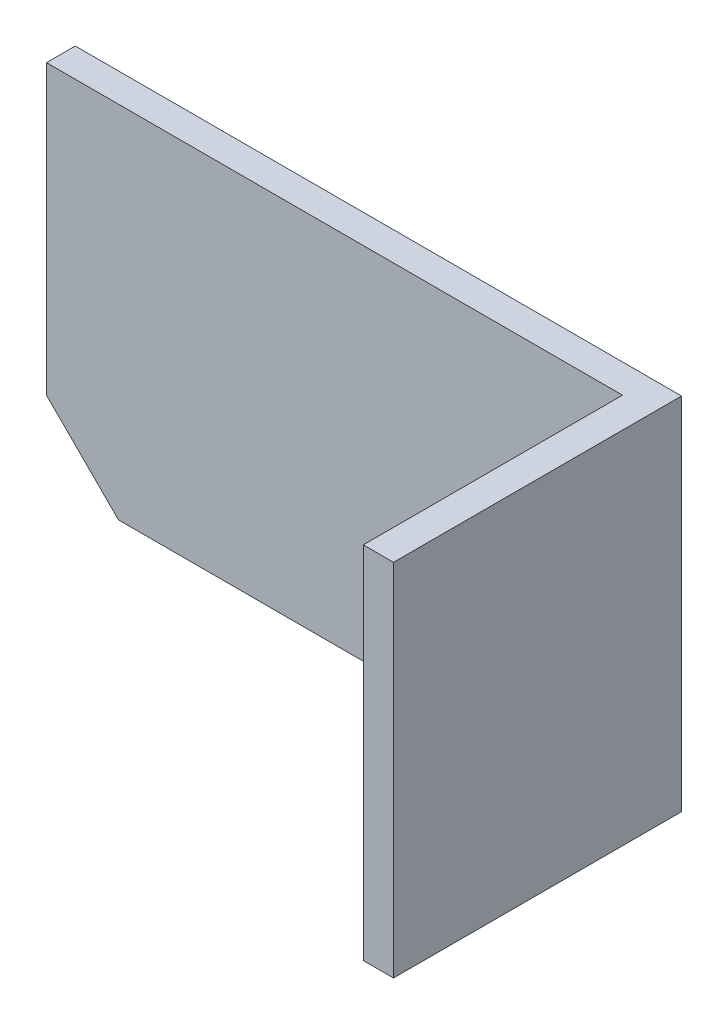
ISO-10303-21;
HEADER;
FILE_DESCRIPTION(('STEP AP214'),'2;1');
FILE_NAME('part.step','',(''),(''),'','','');
FILE_SCHEMA(('AUTOMOTIVE_DESIGN { 1 0 10303 214 1 1 1 1 }'));
ENDSEC;
DATA;
#1=APPLICATION_CONTEXT('core data for automotive mechanical design processes');
#2=APPLICATION_PROTOCOL_DEFINITION('international standard','automotive_design',2000,#1);
#3=PRODUCT_CONTEXT('',#1,'mechanical');
#4=PRODUCT('Part','Part','',(#3));
#5=PRODUCT_RELATED_PRODUCT_CATEGORY('part','',(#4));
#6=PRODUCT_DEFINITION_FORMATION('','',#4);
#7=PRODUCT_DEFINITION_CONTEXT('part definition',#1,'design');
#8=PRODUCT_DEFINITION('design','',#6,#7);
#9=PRODUCT_DEFINITION_SHAPE('','',#8);
#10=(LENGTH_UNIT() NAMED_UNIT(*) SI_UNIT(.MILLI.,.METRE.));
#11=(NAMED_UNIT(*) PLANE_ANGLE_UNIT() SI_UNIT($,.RADIAN.));
#12=(NAMED_UNIT(*) SI_UNIT($,.STERADIAN.) SOLID_ANGLE_UNIT());
#13=UNCERTAINTY_MEASURE_WITH_UNIT(LENGTH_MEASURE(1.E-05),#10,'distance_accuracy_value','');
#14=(GEOMETRIC_REPRESENTATION_CONTEXT(3) GLOBAL_UNCERTAINTY_ASSIGNED_CONTEXT((#13)) GLOBAL_UNIT_ASSIGNED_CONTEXT((#10,
#11,#12)) REPRESENTATION_CONTEXT('',''));
#15=CARTESIAN_POINT('',(0.,0.,0.));
#16=DIRECTION('',(0.,0.,1.));
#17=DIRECTION('',(1.,0.,0.));
#18=AXIS2_PLACEMENT_3D('',#15,#16,#17);
#19=CARTESIAN_POINT('',(1.48217930040456,-0.75,0.2));
#20=DIRECTION('',(0.,0.,1.));
#21=DIRECTION('',(1.,0.,0.));
#22=AXIS2_PLACEMENT_3D('',#19,#20,#21);
#23=PLANE('',#22);
#24=DIRECTION('',(0.,-1.,0.));
#25=VECTOR('',#24,1.);
#26=CARTESIAN_POINT('',(1.49267930040456,-0.75,0.2));
#27=LINE('',#26,#25);
#28=CARTESIAN_POINT('',(1.49267930040456,-0.625,0.2));
#29=VERTEX_POINT('',#28);
#30=CARTESIAN_POINT('',(1.49267930040456,-0.875,0.2));
#31=VERTEX_POINT('',#30);
#32=EDGE_CURVE('E108',#29,#31,#27,.T.);
#33=ORIENTED_EDGE('',*,*,#32,.F.);
#34=DIRECTION('',(1.,0.,0.));
#35=VECTOR('',#34,1.);
#36=CARTESIAN_POINT('',(1.34015031489732,-0.625,0.2));
#37=LINE('',#36,#35);
#38=CARTESIAN_POINT('',(1.47167930040457,-0.625,0.2));
#39=VERTEX_POINT('',#38);
#40=EDGE_CURVE('E122',#39,#29,#37,.T.);
#41=ORIENTED_EDGE('',*,*,#40,.F.);
#42=DIRECTION('',(0.,-1.,0.));
#43=VECTOR('',#42,1.);
#44=CARTESIAN_POINT('',(1.47167930040457,-0.75,0.2));
#45=LINE('',#44,#43);
#46=CARTESIAN_POINT('',(1.47167930040457,-0.875,0.2));
#47=VERTEX_POINT('',#46);
#48=EDGE_CURVE('E11',#39,#47,#45,.T.);
#49=ORIENTED_EDGE('',*,*,#48,.T.);
#50=DIRECTION('',(1.,0.,0.));
#51=VECTOR('',#50,1.);
#52=CARTESIAN_POINT('',(1.36234567518565,-0.875,0.2));
#53=LINE('',#52,#51);
#54=EDGE_CURVE('E92',#47,#31,#53,.T.);
#55=ORIENTED_EDGE('',*,*,#54,.T.);
#56=EDGE_LOOP('',(#33,#41,#49,#55));
#57=FACE_BOUND('',#56,.T.);
#58=ADVANCED_FACE('F16',(#57),#23,.T.);
#59=CARTESIAN_POINT('',(1.27669667488565,-0.746711342510853,0.02));
#60=DIRECTION('',(0.,0.,1.));
#61=DIRECTION('',(1.,0.,0.));
#62=AXIS2_PLACEMENT_3D('',#59,#60,#61);
#63=PLANE('',#62);
#64=DIRECTION('',(0.707106781186547,-0.707106781186548,0.));
#65=VECTOR('',#64,1.);
#66=CARTESIAN_POINT('',(1.09667930040456,-0.85,0.02));
#67=LINE('',#66,#65);
#68=CARTESIAN_POINT('',(1.07167930040456,-0.825,0.02));
#69=VERTEX_POINT('',#68);
#70=CARTESIAN_POINT('',(1.12167930040456,-0.875,0.02));
#71=VERTEX_POINT('',#70);
#72=EDGE_CURVE('E82',#69,#71,#67,.T.);
#73=ORIENTED_EDGE('',*,*,#72,.T.);
#74=DIRECTION('',(1.,0.,0.));
#75=VECTOR('',#74,1.);
#76=CARTESIAN_POINT('',(1.36234567518565,-0.875,0.02));
#77=LINE('',#76,#75);
#78=CARTESIAN_POINT('',(1.47167930040457,-0.875,0.02));
#79=VERTEX_POINT('',#78);
#80=EDGE_CURVE('E79',#71,#79,#77,.T.);
#81=ORIENTED_EDGE('',*,*,#80,.T.);
#82=DIRECTION('',(0.,1.,0.));
#83=VECTOR('',#82,1.);
#84=CARTESIAN_POINT('',(1.47167930040457,-0.75,0.02));
#85=LINE('',#84,#83);
#86=CARTESIAN_POINT('',(1.47167930040457,-0.625,0.02));
#87=VERTEX_POINT('',#86);
#88=EDGE_CURVE('E27',#79,#87,#85,.T.);
#89=ORIENTED_EDGE('',*,*,#88,.T.);
#90=DIRECTION('',(1.,0.,0.));
#91=VECTOR('',#90,1.);
#92=CARTESIAN_POINT('',(1.34015031489732,-0.625,0.02));
#93=LINE('',#92,#91);
#94=CARTESIAN_POINT('',(1.07167930040456,-0.625,0.02));
#95=VERTEX_POINT('',#94);
#96=EDGE_CURVE('E123',#95,#87,#93,.T.);
#97=ORIENTED_EDGE('',*,*,#96,.F.);
#98=DIRECTION('',(0.,-1.,0.));
#99=VECTOR('',#98,1.);
#100=CARTESIAN_POINT('',(1.07167930040456,-0.725,0.02));
#101=LINE('',#100,#99);
#102=EDGE_CURVE('E41',#95,#69,#101,.T.);
#103=ORIENTED_EDGE('',*,*,#102,.T.);
#104=EDGE_LOOP('',(#73,#81,#89,#97,#103));
#105=FACE_BOUND('',#104,.T.);
#106=ADVANCED_FACE('F80',(#105),#63,.T.);
#107=CARTESIAN_POINT('',(1.47167930040457,-0.75,0.11));
#108=DIRECTION('',(1.,0.,0.));
#109=DIRECTION('',(0.,0.,1.));
#110=AXIS2_PLACEMENT_3D('',#107,#108,#109);
#111=PLANE('',#110);
#112=DIRECTION('',(0.,0.,1.));
#113=VECTOR('',#112,1.);
#114=CARTESIAN_POINT('',(1.47167930040457,-0.625,0.0420289855072459));
#115=LINE('',#114,#113);
#116=EDGE_CURVE('E74',#87,#39,#115,.T.);
#117=ORIENTED_EDGE('',*,*,#116,.F.);
#118=ORIENTED_EDGE('',*,*,#88,.F.);
#119=DIRECTION('',(0.,0.,1.));
#120=VECTOR('',#119,1.);
#121=CARTESIAN_POINT('',(1.47167930040457,-0.875,0.0448336252189136));
#122=LINE('',#121,#120);
#123=EDGE_CURVE('E71',#79,#47,#122,.T.);
#124=ORIENTED_EDGE('',*,*,#123,.T.);
#125=ORIENTED_EDGE('',*,*,#48,.F.);
#126=EDGE_LOOP('',(#117,#118,#124,#125));
#127=FACE_BOUND('',#126,.T.);
#128=ADVANCED_FACE('F69',(#127),#111,.F.);
#129=CARTESIAN_POINT('',(1.07167930040456,-0.725,0.01));
#130=DIRECTION('',(1.,0.,0.));
#131=DIRECTION('',(0.,0.,1.));
#132=AXIS2_PLACEMENT_3D('',#129,#130,#131);
#133=PLANE('',#132);
#134=DIRECTION('',(0.,0.,1.));
#135=VECTOR('',#134,1.);
#136=CARTESIAN_POINT('',(1.07167930040456,-0.825,0.01));
#137=LINE('',#136,#135);
#138=CARTESIAN_POINT('',(1.07167930040456,-0.825,0.));
#139=VERTEX_POINT('',#138);
#140=EDGE_CURVE('E125',#139,#69,#137,.T.);
#141=ORIENTED_EDGE('',*,*,#140,.T.);
#142=ORIENTED_EDGE('',*,*,#102,.F.);
#143=DIRECTION('',(0.,0.,1.));
#144=VECTOR('',#143,1.);
#145=CARTESIAN_POINT('',(1.07167930040456,-0.625,0.0420289855072459));
#146=LINE('',#145,#144);
#147=CARTESIAN_POINT('',(1.07167930040456,-0.625,0.));
#148=VERTEX_POINT('',#147);
#149=EDGE_CURVE('E20',#148,#95,#146,.T.);
#150=ORIENTED_EDGE('',*,*,#149,.F.);
#151=DIRECTION('',(0.,-1.,0.));
#152=VECTOR('',#151,1.);
#153=CARTESIAN_POINT('',(1.07167930040456,-0.746816562660918,0.));
#154=LINE('',#153,#152);
#155=EDGE_CURVE('E104',#148,#139,#154,.T.);
#156=ORIENTED_EDGE('',*,*,#155,.T.);
#157=EDGE_LOOP('',(#141,#142,#150,#156));
#158=FACE_BOUND('',#157,.T.);
#159=ADVANCED_FACE('F218',(#158),#133,.F.);
#160=CARTESIAN_POINT('',(1.09667930040456,-0.85,0.01));
#161=DIRECTION('',(0.707106781186548,0.707106781186547,0.));
#162=DIRECTION('',(0.,0.,-1.));
#163=AXIS2_PLACEMENT_3D('',#160,#161,#162);
#164=PLANE('',#163);
#165=DIRECTION('',(0.,0.,1.));
#166=VECTOR('',#165,1.);
#167=CARTESIAN_POINT('',(1.12167930040456,-0.875,0.0448336252189136));
#168=LINE('',#167,#166);
#169=CARTESIAN_POINT('',(1.12167930040456,-0.875,0.));
#170=VERTEX_POINT('',#169);
#171=EDGE_CURVE('E87',#170,#71,#168,.T.);
#172=ORIENTED_EDGE('',*,*,#171,.T.);
#173=ORIENTED_EDGE('',*,*,#72,.F.);
#174=ORIENTED_EDGE('',*,*,#140,.F.);
#175=DIRECTION('',(0.707106781186538,-0.707106781186557,0.));
#176=VECTOR('',#175,1.);
#177=CARTESIAN_POINT('',(1.07167930040456,-0.825,0.));
#178=LINE('',#177,#176);
#179=EDGE_CURVE('E117',#139,#170,#178,.T.);
#180=ORIENTED_EDGE('',*,*,#179,.T.);
#181=EDGE_LOOP('',(#172,#173,#174,#180));
#182=FACE_BOUND('',#181,.T.);
#183=ADVANCED_FACE('F222',(#182),#164,.F.);
#184=CARTESIAN_POINT('',(1.36234567518565,-0.875,0.0448336252189136));
#185=DIRECTION('',(0.,1.,0.));
#186=DIRECTION('',(1.,0.,0.));
#187=AXIS2_PLACEMENT_3D('',#184,#185,#186);
#188=PLANE('',#187);
#189=DIRECTION('',(0.,0.,-1.));
#190=VECTOR('',#189,1.);
#191=CARTESIAN_POINT('',(1.49267930040456,-0.875,0.0999999999999988));
#192=LINE('',#191,#190);
#193=CARTESIAN_POINT('',(1.49267930040456,-0.875,0.));
#194=VERTEX_POINT('',#193);
#195=EDGE_CURVE('E100',#31,#194,#192,.T.);
#196=ORIENTED_EDGE('',*,*,#195,.F.);
#197=ORIENTED_EDGE('',*,*,#54,.F.);
#198=ORIENTED_EDGE('',*,*,#123,.F.);
#199=ORIENTED_EDGE('',*,*,#80,.F.);
#200=ORIENTED_EDGE('',*,*,#171,.F.);
#201=DIRECTION('',(1.,0.,0.));
#202=VECTOR('',#201,1.);
#203=CARTESIAN_POINT('',(1.28727042163972,-0.875,0.));
#204=LINE('',#203,#202);
#205=EDGE_CURVE('E114',#170,#194,#204,.T.);
#206=ORIENTED_EDGE('',*,*,#205,.T.);
#207=EDGE_LOOP('',(#196,#197,#198,#199,#200,#206));
#208=FACE_BOUND('',#207,.T.);
#209=ADVANCED_FACE('F90',(#208),#188,.F.);
#210=CARTESIAN_POINT('',(1.49267930040456,-0.75,0.0999999999999988));
#211=DIRECTION('',(1.,0.,0.));
#212=DIRECTION('',(0.,0.,-1.));
#213=AXIS2_PLACEMENT_3D('',#210,#211,#212);
#214=PLANE('',#213);
#215=ORIENTED_EDGE('',*,*,#32,.T.);
#216=ORIENTED_EDGE('',*,*,#195,.T.);
#217=DIRECTION('',(0.,1.,0.));
#218=VECTOR('',#217,1.);
#219=CARTESIAN_POINT('',(1.49267930040456,-0.746816562660918,0.));
#220=LINE('',#219,#218);
#221=CARTESIAN_POINT('',(1.49267930040456,-0.625,0.));
#222=VERTEX_POINT('',#221);
#223=EDGE_CURVE('E118',#194,#222,#220,.T.);
#224=ORIENTED_EDGE('',*,*,#223,.T.);
#225=DIRECTION('',(0.,0.,-1.));
#226=VECTOR('',#225,1.);
#227=CARTESIAN_POINT('',(1.49267930040456,-0.625,0.0420289855072459));
#228=LINE('',#227,#226);
#229=EDGE_CURVE('E147',#29,#222,#228,.T.);
#230=ORIENTED_EDGE('',*,*,#229,.F.);
#231=EDGE_LOOP('',(#215,#216,#224,#230));
#232=FACE_BOUND('',#231,.T.);
#233=ADVANCED_FACE('F210',(#232),#214,.T.);
#234=CARTESIAN_POINT('',(1.34015031489732,-0.625,0.0420289855072459));
#235=DIRECTION('',(0.,1.,0.));
#236=DIRECTION('',(0.,0.,-1.));
#237=AXIS2_PLACEMENT_3D('',#234,#235,#236);
#238=PLANE('',#237);
#239=ORIENTED_EDGE('',*,*,#96,.T.);
#240=ORIENTED_EDGE('',*,*,#116,.T.);
#241=ORIENTED_EDGE('',*,*,#40,.T.);
#242=ORIENTED_EDGE('',*,*,#229,.T.);
#243=DIRECTION('',(-1.,0.,0.));
#244=VECTOR('',#243,1.);
#245=CARTESIAN_POINT('',(1.28727042163972,-0.625,0.));
#246=LINE('',#245,#244);
#247=EDGE_CURVE('E142',#222,#148,#246,.T.);
#248=ORIENTED_EDGE('',*,*,#247,.T.);
#249=ORIENTED_EDGE('',*,*,#149,.T.);
#250=EDGE_LOOP('',(#239,#240,#241,#242,#248,#249));
#251=FACE_BOUND('',#250,.T.);
#252=ADVANCED_FACE('F18',(#251),#238,.T.);
#253=CARTESIAN_POINT('',(1.28727042163972,-0.746816562660918,0.));
#254=DIRECTION('',(0.,0.,1.));
#255=DIRECTION('',(1.,0.,0.));
#256=AXIS2_PLACEMENT_3D('',#253,#254,#255);
#257=PLANE('',#256);
#258=ORIENTED_EDGE('',*,*,#223,.F.);
#259=ORIENTED_EDGE('',*,*,#205,.F.);
#260=ORIENTED_EDGE('',*,*,#179,.F.);
#261=ORIENTED_EDGE('',*,*,#155,.F.);
#262=ORIENTED_EDGE('',*,*,#247,.F.);
#263=EDGE_LOOP('',(#258,#259,#260,#261,#262));
#264=FACE_BOUND('',#263,.T.);
#265=ADVANCED_FACE('F209',(#264),#257,.F.);
#266=CLOSED_SHELL('',(#58,#106,#128,#159,#183,#209,#233,#252,#265));
#267=MANIFOLD_SOLID_BREP('B1',#266);
#268=ADVANCED_BREP_SHAPE_REPRESENTATION('',(#18,#267),#14);
#269=SHAPE_DEFINITION_REPRESENTATION(#9,#268);
ENDSEC;
END-ISO-10303-21;
